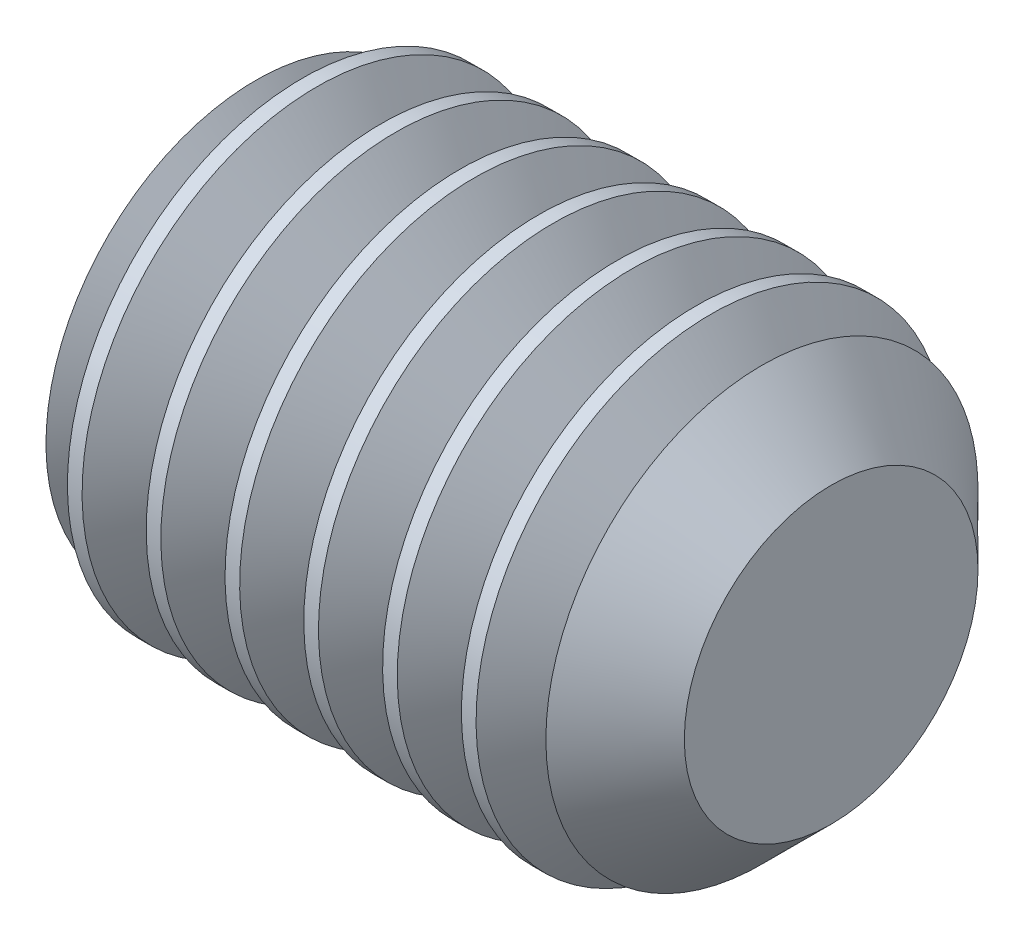
ISO-10303-21;
HEADER;
FILE_DESCRIPTION(('STEP AP214'),'2;1');
FILE_NAME('part.step','',(''),(''),'','','');
FILE_SCHEMA(('AUTOMOTIVE_DESIGN { 1 0 10303 214 1 1 1 1 }'));
ENDSEC;
DATA;
#1=APPLICATION_CONTEXT('core data for automotive mechanical design processes');
#2=APPLICATION_PROTOCOL_DEFINITION('international standard','automotive_design',2000,#1);
#3=PRODUCT_CONTEXT('',#1,'mechanical');
#4=PRODUCT('Part','Part','',(#3));
#5=PRODUCT_RELATED_PRODUCT_CATEGORY('part','',(#4));
#6=PRODUCT_DEFINITION_FORMATION('','',#4);
#7=PRODUCT_DEFINITION_CONTEXT('part definition',#1,'design');
#8=PRODUCT_DEFINITION('design','',#6,#7);
#9=PRODUCT_DEFINITION_SHAPE('','',#8);
#10=(LENGTH_UNIT() NAMED_UNIT(*) SI_UNIT(.MILLI.,.METRE.));
#11=(NAMED_UNIT(*) PLANE_ANGLE_UNIT() SI_UNIT($,.RADIAN.));
#12=(NAMED_UNIT(*) SI_UNIT($,.STERADIAN.) SOLID_ANGLE_UNIT());
#13=UNCERTAINTY_MEASURE_WITH_UNIT(LENGTH_MEASURE(1.E-05),#10,'distance_accuracy_value','');
#14=(GEOMETRIC_REPRESENTATION_CONTEXT(3) GLOBAL_UNCERTAINTY_ASSIGNED_CONTEXT((#13)) GLOBAL_UNIT_ASSIGNED_CONTEXT((#10,
#11,#12)) REPRESENTATION_CONTEXT('',''));
#15=CARTESIAN_POINT('',(0.,0.,0.));
#16=DIRECTION('',(0.,0.,1.));
#17=DIRECTION('',(1.,0.,0.));
#18=AXIS2_PLACEMENT_3D('',#15,#16,#17);
#19=CARTESIAN_POINT('',(0.,0.,0.));
#20=DIRECTION('',(-1.,0.,0.));
#21=DIRECTION('',(0.,0.,1.));
#22=AXIS2_PLACEMENT_3D('',#19,#20,#21);
#23=PLANE('',#22);
#24=CARTESIAN_POINT('',(0.,0.,0.));
#25=DIRECTION('',(-1.,0.,0.));
#26=DIRECTION('',(0.,0.,1.));
#27=AXIS2_PLACEMENT_3D('',#24,#25,#26);
#28=CIRCLE('',#27,1.61);
#29=CARTESIAN_POINT('',(0.,0.,1.61));
#30=VERTEX_POINT('',#29);
#31=EDGE_CURVE('E26',#30,#30,#28,.T.);
#32=ORIENTED_EDGE('',*,*,#31,.T.);
#33=EDGE_LOOP('',(#32));
#34=FACE_BOUND('',#33,.T.);
#35=DIRECTION('',(0.,0.,-1.));
#36=VECTOR('',#35,1.);
#37=CARTESIAN_POINT('',(0.,1.,0.577350269189622));
#38=LINE('',#37,#36);
#39=CARTESIAN_POINT('',(0.,1.,0.577350269189622));
#40=VERTEX_POINT('',#39);
#41=CARTESIAN_POINT('',(0.,1.,-0.577350269189629));
#42=VERTEX_POINT('',#41);
#43=EDGE_CURVE('E113',#40,#42,#38,.T.);
#44=ORIENTED_EDGE('',*,*,#43,.F.);
#45=DIRECTION('',(0.,-0.866025403784438,0.5));
#46=VECTOR('',#45,1.);
#47=CARTESIAN_POINT('',(0.,1.,0.577350269189622));
#48=LINE('',#47,#46);
#49=CARTESIAN_POINT('',(0.,0.,1.15470053837925));
#50=VERTEX_POINT('',#49);
#51=EDGE_CURVE('E34',#40,#50,#48,.T.);
#52=ORIENTED_EDGE('',*,*,#51,.T.);
#53=DIRECTION('',(0.,0.866025403784439,0.5));
#54=VECTOR('',#53,1.);
#55=CARTESIAN_POINT('',(0.,-1.,0.577350269189623));
#56=LINE('',#55,#54);
#57=CARTESIAN_POINT('',(0.,-1.,0.577350269189623));
#58=VERTEX_POINT('',#57);
#59=EDGE_CURVE('E103',#58,#50,#56,.T.);
#60=ORIENTED_EDGE('',*,*,#59,.F.);
#61=DIRECTION('',(0.,0.,-1.));
#62=VECTOR('',#61,1.);
#63=CARTESIAN_POINT('',(0.,-1.,0.577350269189623));
#64=LINE('',#63,#62);
#65=CARTESIAN_POINT('',(0.,-1.,-0.577350269189628));
#66=VERTEX_POINT('',#65);
#67=EDGE_CURVE('E107',#58,#66,#64,.T.);
#68=ORIENTED_EDGE('',*,*,#67,.T.);
#69=DIRECTION('',(0.,0.866025403784438,-0.5));
#70=VECTOR('',#69,1.);
#71=CARTESIAN_POINT('',(0.,-1.,-0.577350269189628));
#72=LINE('',#71,#70);
#73=CARTESIAN_POINT('',(0.,0.,-1.15470053837925));
#74=VERTEX_POINT('',#73);
#75=EDGE_CURVE('E110',#66,#74,#72,.T.);
#76=ORIENTED_EDGE('',*,*,#75,.T.);
#77=DIRECTION('',(0.,-0.866025403784439,-0.5));
#78=VECTOR('',#77,1.);
#79=CARTESIAN_POINT('',(0.,1.,-0.577350269189629));
#80=LINE('',#79,#78);
#81=EDGE_CURVE('E92',#42,#74,#80,.T.);
#82=ORIENTED_EDGE('',*,*,#81,.F.);
#83=EDGE_LOOP('',(#44,#52,#60,#68,#76,#82));
#84=FACE_BOUND('',#83,.T.);
#85=ADVANCED_FACE('F17',(#34,#84),#23,.T.);
#86=CARTESIAN_POINT('',(0.,0.,0.));
#87=DIRECTION('',(1.,0.,0.));
#88=DIRECTION('',(0.,0.,-1.));
#89=AXIS2_PLACEMENT_3D('',#86,#87,#88);
#90=CONICAL_SURFACE('',#89,1.61,1.0471975511966);
#91=CARTESIAN_POINT('',(0.101756647916099,0.,0.));
#92=DIRECTION('',(-1.,0.,0.));
#93=DIRECTION('',(0.,-1.,0.));
#94=AXIS2_PLACEMENT_3D('',#91,#92,#93);
#95=CIRCLE('',#94,1.78624768419859);
#96=CARTESIAN_POINT('',(0.1017566479161,-1.78624768419859,0.));
#97=VERTEX_POINT('',#96);
#98=EDGE_CURVE('E104',#97,#97,#95,.F.);
#99=ORIENTED_EDGE('',*,*,#98,.F.);
#100=EDGE_LOOP('',(#99));
#101=FACE_BOUND('',#100,.T.);
#102=ORIENTED_EDGE('',*,*,#31,.F.);
#103=EDGE_LOOP('',(#102));
#104=FACE_BOUND('',#103,.T.);
#105=ADVANCED_FACE('F149',(#101,#104),#90,.T.);
#106=CARTESIAN_POINT('',(2.3,1.,0.577350269189622));
#107=DIRECTION('',(0.,-0.5,-0.866025403784438));
#108=DIRECTION('',(0.,0.866025403784438,-0.5));
#109=AXIS2_PLACEMENT_3D('',#106,#107,#108);
#110=PLANE('',#109);
#111=ORIENTED_EDGE('',*,*,#51,.F.);
#112=DIRECTION('',(-1.,0.,0.));
#113=VECTOR('',#112,1.);
#114=CARTESIAN_POINT('',(2.3,1.,0.577350269189622));
#115=LINE('',#114,#113);
#116=CARTESIAN_POINT('',(2.3,1.,0.577350269189622));
#117=VERTEX_POINT('',#116);
#118=EDGE_CURVE('E39',#117,#40,#115,.T.);
#119=ORIENTED_EDGE('',*,*,#118,.F.);
#120=DIRECTION('',(0.,-0.866025403784438,0.5));
#121=VECTOR('',#120,1.);
#122=CARTESIAN_POINT('',(2.3,1.,0.577350269189622));
#123=LINE('',#122,#121);
#124=CARTESIAN_POINT('',(2.3,0.,1.15470053837925));
#125=VERTEX_POINT('',#124);
#126=EDGE_CURVE('E66',#117,#125,#123,.T.);
#127=ORIENTED_EDGE('',*,*,#126,.T.);
#128=DIRECTION('',(-1.,0.,0.));
#129=VECTOR('',#128,1.);
#130=CARTESIAN_POINT('',(2.3,0.,1.15470053837925));
#131=LINE('',#130,#129);
#132=EDGE_CURVE('E120',#125,#50,#131,.T.);
#133=ORIENTED_EDGE('',*,*,#132,.T.);
#134=EDGE_LOOP('',(#111,#119,#127,#133));
#135=FACE_BOUND('',#134,.T.);
#136=ADVANCED_FACE('F147',(#135),#110,.T.);
#137=CARTESIAN_POINT('',(2.3,-1.,0.577350269189623));
#138=DIRECTION('',(0.,-0.5,0.866025403784439));
#139=DIRECTION('',(0.,-0.866025403784439,-0.5));
#140=AXIS2_PLACEMENT_3D('',#137,#138,#139);
#141=PLANE('',#140);
#142=ORIENTED_EDGE('',*,*,#59,.T.);
#143=ORIENTED_EDGE('',*,*,#132,.F.);
#144=DIRECTION('',(0.,0.866025403784439,0.5));
#145=VECTOR('',#144,1.);
#146=CARTESIAN_POINT('',(2.3,-1.,0.577350269189623));
#147=LINE('',#146,#145);
#148=CARTESIAN_POINT('',(2.3,-1.,0.577350269189623));
#149=VERTEX_POINT('',#148);
#150=EDGE_CURVE('E138',#149,#125,#147,.T.);
#151=ORIENTED_EDGE('',*,*,#150,.F.);
#152=DIRECTION('',(-1.,0.,0.));
#153=VECTOR('',#152,1.);
#154=CARTESIAN_POINT('',(2.3,-1.,0.577350269189623));
#155=LINE('',#154,#153);
#156=EDGE_CURVE('E118',#149,#58,#155,.T.);
#157=ORIENTED_EDGE('',*,*,#156,.T.);
#158=EDGE_LOOP('',(#142,#143,#151,#157));
#159=FACE_BOUND('',#158,.T.);
#160=ADVANCED_FACE('F145',(#159),#141,.F.);
#161=CARTESIAN_POINT('',(2.3,-1.,0.577350269189623));
#162=DIRECTION('',(0.,1.,0.));
#163=DIRECTION('',(0.,0.,1.));
#164=AXIS2_PLACEMENT_3D('',#161,#162,#163);
#165=PLANE('',#164);
#166=ORIENTED_EDGE('',*,*,#67,.F.);
#167=ORIENTED_EDGE('',*,*,#156,.F.);
#168=DIRECTION('',(0.,0.,-1.));
#169=VECTOR('',#168,1.);
#170=CARTESIAN_POINT('',(2.3,-1.,0.577350269189623));
#171=LINE('',#170,#169);
#172=CARTESIAN_POINT('',(2.3,-1.,-0.577350269189628));
#173=VERTEX_POINT('',#172);
#174=EDGE_CURVE('E87',#149,#173,#171,.T.);
#175=ORIENTED_EDGE('',*,*,#174,.T.);
#176=DIRECTION('',(-1.,0.,0.));
#177=VECTOR('',#176,1.);
#178=CARTESIAN_POINT('',(2.3,-1.,-0.577350269189628));
#179=LINE('',#178,#177);
#180=EDGE_CURVE('E82',#173,#66,#179,.T.);
#181=ORIENTED_EDGE('',*,*,#180,.T.);
#182=EDGE_LOOP('',(#166,#167,#175,#181));
#183=FACE_BOUND('',#182,.T.);
#184=ADVANCED_FACE('F142',(#183),#165,.T.);
#185=CARTESIAN_POINT('',(2.3,-1.,-0.577350269189628));
#186=DIRECTION('',(0.,0.5,0.866025403784438));
#187=DIRECTION('',(0.,-0.866025403784439,0.5));
#188=AXIS2_PLACEMENT_3D('',#185,#186,#187);
#189=PLANE('',#188);
#190=ORIENTED_EDGE('',*,*,#75,.F.);
#191=ORIENTED_EDGE('',*,*,#180,.F.);
#192=DIRECTION('',(0.,0.866025403784438,-0.5));
#193=VECTOR('',#192,1.);
#194=CARTESIAN_POINT('',(2.3,-1.,-0.577350269189628));
#195=LINE('',#194,#193);
#196=CARTESIAN_POINT('',(2.3,0.,-1.15470053837925));
#197=VERTEX_POINT('',#196);
#198=EDGE_CURVE('E77',#173,#197,#195,.T.);
#199=ORIENTED_EDGE('',*,*,#198,.T.);
#200=DIRECTION('',(-1.,0.,0.));
#201=VECTOR('',#200,1.);
#202=CARTESIAN_POINT('',(2.3,0.,-1.15470053837925));
#203=LINE('',#202,#201);
#204=EDGE_CURVE('E81',#197,#74,#203,.T.);
#205=ORIENTED_EDGE('',*,*,#204,.T.);
#206=EDGE_LOOP('',(#190,#191,#199,#205));
#207=FACE_BOUND('',#206,.T.);
#208=ADVANCED_FACE('F80',(#207),#189,.T.);
#209=CARTESIAN_POINT('',(2.3,1.,-0.577350269189629));
#210=DIRECTION('',(0.,0.5,-0.866025403784439));
#211=DIRECTION('',(0.,0.866025403784439,0.5));
#212=AXIS2_PLACEMENT_3D('',#209,#210,#211);
#213=PLANE('',#212);
#214=ORIENTED_EDGE('',*,*,#81,.T.);
#215=ORIENTED_EDGE('',*,*,#204,.F.);
#216=DIRECTION('',(0.,-0.866025403784439,-0.5));
#217=VECTOR('',#216,1.);
#218=CARTESIAN_POINT('',(2.3,1.,-0.577350269189629));
#219=LINE('',#218,#217);
#220=CARTESIAN_POINT('',(2.3,1.,-0.577350269189629));
#221=VERTEX_POINT('',#220);
#222=EDGE_CURVE('E86',#221,#197,#219,.T.);
#223=ORIENTED_EDGE('',*,*,#222,.F.);
#224=DIRECTION('',(-1.,0.,0.));
#225=VECTOR('',#224,1.);
#226=CARTESIAN_POINT('',(2.3,1.,-0.577350269189629));
#227=LINE('',#226,#225);
#228=EDGE_CURVE('E62',#221,#42,#227,.T.);
#229=ORIENTED_EDGE('',*,*,#228,.T.);
#230=EDGE_LOOP('',(#214,#215,#223,#229));
#231=FACE_BOUND('',#230,.T.);
#232=ADVANCED_FACE('F89',(#231),#213,.F.);
#233=CARTESIAN_POINT('',(2.3,1.,0.577350269189622));
#234=DIRECTION('',(0.,1.,0.));
#235=DIRECTION('',(0.,0.,1.));
#236=AXIS2_PLACEMENT_3D('',#233,#234,#235);
#237=PLANE('',#236);
#238=ORIENTED_EDGE('',*,*,#43,.T.);
#239=ORIENTED_EDGE('',*,*,#228,.F.);
#240=DIRECTION('',(0.,0.,-1.));
#241=VECTOR('',#240,1.);
#242=CARTESIAN_POINT('',(2.3,1.,0.577350269189622));
#243=LINE('',#242,#241);
#244=EDGE_CURVE('E97',#117,#221,#243,.T.);
#245=ORIENTED_EDGE('',*,*,#244,.F.);
#246=ORIENTED_EDGE('',*,*,#118,.T.);
#247=EDGE_LOOP('',(#238,#239,#245,#246));
#248=FACE_BOUND('',#247,.T.);
#249=ADVANCED_FACE('F333',(#248),#237,.F.);
#250=CARTESIAN_POINT('',(2.3,2.,0.));
#251=DIRECTION('',(1.,0.,0.));
#252=DIRECTION('',(0.,0.,-1.));
#253=AXIS2_PLACEMENT_3D('',#250,#251,#252);
#254=PLANE('',#253);
#255=ORIENTED_EDGE('',*,*,#126,.F.);
#256=ORIENTED_EDGE('',*,*,#244,.T.);
#257=ORIENTED_EDGE('',*,*,#222,.T.);
#258=ORIENTED_EDGE('',*,*,#198,.F.);
#259=ORIENTED_EDGE('',*,*,#174,.F.);
#260=ORIENTED_EDGE('',*,*,#150,.T.);
#261=EDGE_LOOP('',(#255,#256,#257,#258,#259,#260));
#262=FACE_BOUND('',#261,.T.);
#263=ADVANCED_FACE('F95',(#262),#254,.F.);
#264=CARTESIAN_POINT('',(0.498247544885738,0.,0.));
#265=DIRECTION('',(1.,0.,0.));
#266=DIRECTION('',(0.,1.,0.));
#267=AXIS2_PLACEMENT_3D('',#264,#265,#266);
#268=CONICAL_SURFACE('',#267,2.,0.959931088596884);
#269=CARTESIAN_POINT('',(0.225166604983952,0.,0.));
#270=DIRECTION('',(-1.,0.,0.));
#271=DIRECTION('',(0.,-1.,0.));
#272=AXIS2_PLACEMENT_3D('',#269,#270,#271);
#273=CIRCLE('',#272,1.61);
#274=CARTESIAN_POINT('',(0.225166604983953,-1.61,0.));
#275=VERTEX_POINT('',#274);
#276=EDGE_CURVE('E128',#275,#275,#273,.T.);
#277=ORIENTED_EDGE('',*,*,#276,.F.);
#278=EDGE_LOOP('',(#277));
#279=FACE_BOUND('',#278,.T.);
#280=CARTESIAN_POINT('',(0.498247544885738,0.,0.));
#281=DIRECTION('',(-1.,0.,0.));
#282=DIRECTION('',(0.,-1.,0.));
#283=AXIS2_PLACEMENT_3D('',#280,#281,#282);
#284=CIRCLE('',#283,2.);
#285=CARTESIAN_POINT('',(0.498247544885738,-2.,0.));
#286=VERTEX_POINT('',#285);
#287=EDGE_CURVE('E124',#286,#286,#284,.T.);
#288=ORIENTED_EDGE('',*,*,#287,.T.);
#289=EDGE_LOOP('',(#288));
#290=FACE_BOUND('',#289,.T.);
#291=ADVANCED_FACE('F327',(#279,#290),#268,.T.);
#292=CARTESIAN_POINT('',(0.225166604983952,0.,0.));
#293=DIRECTION('',(-1.,0.,0.));
#294=DIRECTION('',(0.,-1.,0.));
#295=AXIS2_PLACEMENT_3D('',#292,#293,#294);
#296=CONICAL_SURFACE('',#295,1.61,0.959931088596876);
#297=ORIENTED_EDGE('',*,*,#98,.T.);
#298=EDGE_LOOP('',(#297));
#299=FACE_BOUND('',#298,.T.);
#300=ORIENTED_EDGE('',*,*,#276,.T.);
#301=EDGE_LOOP('',(#300));
#302=FACE_BOUND('',#301,.T.);
#303=ADVANCED_FACE('F171',(#299,#302),#296,.T.);
#304=CARTESIAN_POINT('',(-12.7,0.,0.));
#305=DIRECTION('',(-1.,0.,0.));
#306=DIRECTION('',(0.,0.,1.));
#307=AXIS2_PLACEMENT_3D('',#304,#305,#306);
#308=CYLINDRICAL_SURFACE('',#307,2.);
#309=CARTESIAN_POINT('',(0.622891234063827,0.,0.));
#310=DIRECTION('',(-1.,0.,0.));
#311=DIRECTION('',(0.,-1.,0.));
#312=AXIS2_PLACEMENT_3D('',#309,#310,#311);
#313=CIRCLE('',#312,2.);
#314=CARTESIAN_POINT('',(0.622891234063827,-2.,0.));
#315=VERTEX_POINT('',#314);
#316=EDGE_CURVE('E237',#315,#315,#313,.T.);
#317=ORIENTED_EDGE('',*,*,#316,.T.);
#318=EDGE_LOOP('',(#317));
#319=FACE_BOUND('',#318,.T.);
#320=ORIENTED_EDGE('',*,*,#287,.F.);
#321=EDGE_LOOP('',(#320));
#322=FACE_BOUND('',#321,.T.);
#323=ADVANCED_FACE('F168',(#319,#322),#308,.T.);
#324=CARTESIAN_POINT('',(1.1690531138674,0.,0.));
#325=DIRECTION('',(1.,0.,0.));
#326=DIRECTION('',(0.,1.,0.));
#327=AXIS2_PLACEMENT_3D('',#324,#325,#326);
#328=CONICAL_SURFACE('',#327,2.,0.959931088596884);
#329=CARTESIAN_POINT('',(0.895972173965617,0.,0.));
#330=DIRECTION('',(-1.,0.,0.));
#331=DIRECTION('',(0.,-1.,0.));
#332=AXIS2_PLACEMENT_3D('',#329,#330,#331);
#333=CIRCLE('',#332,1.61);
#334=CARTESIAN_POINT('',(0.895972173965617,-1.61,0.));
#335=VERTEX_POINT('',#334);
#336=EDGE_CURVE('E234',#335,#335,#333,.T.);
#337=ORIENTED_EDGE('',*,*,#336,.F.);
#338=EDGE_LOOP('',(#337));
#339=FACE_BOUND('',#338,.T.);
#340=CARTESIAN_POINT('',(1.1690531138674,0.,0.));
#341=DIRECTION('',(-1.,0.,0.));
#342=DIRECTION('',(0.,-1.,0.));
#343=AXIS2_PLACEMENT_3D('',#340,#341,#342);
#344=CIRCLE('',#343,2.);
#345=CARTESIAN_POINT('',(1.1690531138674,-2.,0.));
#346=VERTEX_POINT('',#345);
#347=EDGE_CURVE('E133',#346,#346,#344,.T.);
#348=ORIENTED_EDGE('',*,*,#347,.T.);
#349=EDGE_LOOP('',(#348));
#350=FACE_BOUND('',#349,.T.);
#351=ADVANCED_FACE('F170',(#339,#350),#328,.T.);
#352=CARTESIAN_POINT('',(0.895972173965617,0.,0.));
#353=DIRECTION('',(-1.,0.,0.));
#354=DIRECTION('',(0.,-1.,0.));
#355=AXIS2_PLACEMENT_3D('',#352,#353,#354);
#356=CONICAL_SURFACE('',#355,1.61,0.959931088596876);
#357=ORIENTED_EDGE('',*,*,#316,.F.);
#358=EDGE_LOOP('',(#357));
#359=FACE_BOUND('',#358,.T.);
#360=ORIENTED_EDGE('',*,*,#336,.T.);
#361=EDGE_LOOP('',(#360));
#362=FACE_BOUND('',#361,.T.);
#363=ADVANCED_FACE('F245',(#359,#362),#356,.T.);
#364=CARTESIAN_POINT('',(1.29369680304549,0.,0.));
#365=DIRECTION('',(-1.,0.,0.));
#366=DIRECTION('',(0.,-1.,0.));
#367=AXIS2_PLACEMENT_3D('',#364,#365,#366);
#368=CIRCLE('',#367,2.);
#369=CARTESIAN_POINT('',(1.29369680304549,-2.,0.));
#370=VERTEX_POINT('',#369);
#371=EDGE_CURVE('E228',#370,#370,#368,.T.);
#372=ORIENTED_EDGE('',*,*,#371,.T.);
#373=EDGE_LOOP('',(#372));
#374=FACE_BOUND('',#373,.T.);
#375=ORIENTED_EDGE('',*,*,#347,.F.);
#376=EDGE_LOOP('',(#375));
#377=FACE_BOUND('',#376,.T.);
#378=ADVANCED_FACE('F174',(#374,#377),#308,.T.);
#379=CARTESIAN_POINT('',(1.83985868284907,0.,0.));
#380=DIRECTION('',(1.,0.,0.));
#381=DIRECTION('',(0.,1.,0.));
#382=AXIS2_PLACEMENT_3D('',#379,#380,#381);
#383=CONICAL_SURFACE('',#382,2.,0.959931088596884);
#384=CARTESIAN_POINT('',(1.56677774294728,0.,0.));
#385=DIRECTION('',(-1.,0.,0.));
#386=DIRECTION('',(0.,-1.,0.));
#387=AXIS2_PLACEMENT_3D('',#384,#385,#386);
#388=CIRCLE('',#387,1.61);
#389=CARTESIAN_POINT('',(1.56677774294728,-1.61,0.));
#390=VERTEX_POINT('',#389);
#391=EDGE_CURVE('E225',#390,#390,#388,.T.);
#392=ORIENTED_EDGE('',*,*,#391,.F.);
#393=EDGE_LOOP('',(#392));
#394=FACE_BOUND('',#393,.T.);
#395=CARTESIAN_POINT('',(1.83985868284907,0.,0.));
#396=DIRECTION('',(-1.,0.,0.));
#397=DIRECTION('',(0.,-1.,0.));
#398=AXIS2_PLACEMENT_3D('',#395,#396,#397);
#399=CIRCLE('',#398,2.);
#400=CARTESIAN_POINT('',(1.83985868284907,-2.,0.));
#401=VERTEX_POINT('',#400);
#402=EDGE_CURVE('E231',#401,#401,#399,.T.);
#403=ORIENTED_EDGE('',*,*,#402,.T.);
#404=EDGE_LOOP('',(#403));
#405=FACE_BOUND('',#404,.T.);
#406=ADVANCED_FACE('F244',(#394,#405),#383,.T.);
#407=CARTESIAN_POINT('',(1.56677774294728,0.,0.));
#408=DIRECTION('',(-1.,0.,0.));
#409=DIRECTION('',(0.,-1.,0.));
#410=AXIS2_PLACEMENT_3D('',#407,#408,#409);
#411=CONICAL_SURFACE('',#410,1.61,0.959931088596876);
#412=ORIENTED_EDGE('',*,*,#371,.F.);
#413=EDGE_LOOP('',(#412));
#414=FACE_BOUND('',#413,.T.);
#415=ORIENTED_EDGE('',*,*,#391,.T.);
#416=EDGE_LOOP('',(#415));
#417=FACE_BOUND('',#416,.T.);
#418=ADVANCED_FACE('F253',(#414,#417),#411,.T.);
#419=CARTESIAN_POINT('',(1.96450237202716,0.,0.));
#420=DIRECTION('',(-1.,0.,0.));
#421=DIRECTION('',(0.,-1.,0.));
#422=AXIS2_PLACEMENT_3D('',#419,#420,#421);
#423=CIRCLE('',#422,2.);
#424=CARTESIAN_POINT('',(1.96450237202716,-2.,0.));
#425=VERTEX_POINT('',#424);
#426=EDGE_CURVE('E219',#425,#425,#423,.T.);
#427=ORIENTED_EDGE('',*,*,#426,.T.);
#428=EDGE_LOOP('',(#427));
#429=FACE_BOUND('',#428,.T.);
#430=ORIENTED_EDGE('',*,*,#402,.F.);
#431=EDGE_LOOP('',(#430));
#432=FACE_BOUND('',#431,.T.);
#433=ADVANCED_FACE('F247',(#429,#432),#308,.T.);
#434=CARTESIAN_POINT('',(2.51066425183073,0.,0.));
#435=DIRECTION('',(1.,0.,0.));
#436=DIRECTION('',(0.,1.,0.));
#437=AXIS2_PLACEMENT_3D('',#434,#435,#436);
#438=CONICAL_SURFACE('',#437,2.,0.959931088596884);
#439=CARTESIAN_POINT('',(2.23758331192894,0.,0.));
#440=DIRECTION('',(-1.,0.,0.));
#441=DIRECTION('',(0.,-1.,0.));
#442=AXIS2_PLACEMENT_3D('',#439,#440,#441);
#443=CIRCLE('',#442,1.61);
#444=CARTESIAN_POINT('',(2.23758331192894,-1.61,0.));
#445=VERTEX_POINT('',#444);
#446=EDGE_CURVE('E216',#445,#445,#443,.T.);
#447=ORIENTED_EDGE('',*,*,#446,.F.);
#448=EDGE_LOOP('',(#447));
#449=FACE_BOUND('',#448,.T.);
#450=CARTESIAN_POINT('',(2.51066425183073,0.,0.));
#451=DIRECTION('',(-1.,0.,0.));
#452=DIRECTION('',(0.,-1.,0.));
#453=AXIS2_PLACEMENT_3D('',#450,#451,#452);
#454=CIRCLE('',#453,2.);
#455=CARTESIAN_POINT('',(2.51066425183073,-2.,0.));
#456=VERTEX_POINT('',#455);
#457=EDGE_CURVE('E222',#456,#456,#454,.T.);
#458=ORIENTED_EDGE('',*,*,#457,.T.);
#459=EDGE_LOOP('',(#458));
#460=FACE_BOUND('',#459,.T.);
#461=ADVANCED_FACE('F259',(#449,#460),#438,.T.);
#462=CARTESIAN_POINT('',(2.23758331192894,0.,0.));
#463=DIRECTION('',(-1.,0.,0.));
#464=DIRECTION('',(0.,-1.,0.));
#465=AXIS2_PLACEMENT_3D('',#462,#463,#464);
#466=CONICAL_SURFACE('',#465,1.61,0.959931088596876);
#467=ORIENTED_EDGE('',*,*,#426,.F.);
#468=EDGE_LOOP('',(#467));
#469=FACE_BOUND('',#468,.T.);
#470=ORIENTED_EDGE('',*,*,#446,.T.);
#471=EDGE_LOOP('',(#470));
#472=FACE_BOUND('',#471,.T.);
#473=ADVANCED_FACE('F267',(#469,#472),#466,.T.);
#474=CARTESIAN_POINT('',(2.63530794100882,0.,0.));
#475=DIRECTION('',(-1.,0.,0.));
#476=DIRECTION('',(0.,-1.,0.));
#477=AXIS2_PLACEMENT_3D('',#474,#475,#476);
#478=CIRCLE('',#477,2.);
#479=CARTESIAN_POINT('',(2.63530794100882,-2.,0.));
#480=VERTEX_POINT('',#479);
#481=EDGE_CURVE('E210',#480,#480,#478,.T.);
#482=ORIENTED_EDGE('',*,*,#481,.T.);
#483=EDGE_LOOP('',(#482));
#484=FACE_BOUND('',#483,.T.);
#485=ORIENTED_EDGE('',*,*,#457,.F.);
#486=EDGE_LOOP('',(#485));
#487=FACE_BOUND('',#486,.T.);
#488=ADVANCED_FACE('F261',(#484,#487),#308,.T.);
#489=CARTESIAN_POINT('',(3.18146982081239,0.,0.));
#490=DIRECTION('',(1.,0.,0.));
#491=DIRECTION('',(0.,1.,0.));
#492=AXIS2_PLACEMENT_3D('',#489,#490,#491);
#493=CONICAL_SURFACE('',#492,2.,0.959931088596884);
#494=CARTESIAN_POINT('',(2.90838888091061,0.,0.));
#495=DIRECTION('',(-1.,0.,0.));
#496=DIRECTION('',(0.,-1.,0.));
#497=AXIS2_PLACEMENT_3D('',#494,#495,#496);
#498=CIRCLE('',#497,1.61);
#499=CARTESIAN_POINT('',(2.90838888091061,-1.61,0.));
#500=VERTEX_POINT('',#499);
#501=EDGE_CURVE('E207',#500,#500,#498,.T.);
#502=ORIENTED_EDGE('',*,*,#501,.F.);
#503=EDGE_LOOP('',(#502));
#504=FACE_BOUND('',#503,.T.);
#505=CARTESIAN_POINT('',(3.18146982081239,0.,0.));
#506=DIRECTION('',(-1.,0.,0.));
#507=DIRECTION('',(0.,-1.,0.));
#508=AXIS2_PLACEMENT_3D('',#505,#506,#507);
#509=CIRCLE('',#508,2.);
#510=CARTESIAN_POINT('',(3.1814698208124,-2.,0.));
#511=VERTEX_POINT('',#510);
#512=EDGE_CURVE('E213',#511,#511,#509,.T.);
#513=ORIENTED_EDGE('',*,*,#512,.T.);
#514=EDGE_LOOP('',(#513));
#515=FACE_BOUND('',#514,.T.);
#516=ADVANCED_FACE('F274',(#504,#515),#493,.T.);
#517=CARTESIAN_POINT('',(2.90838888091061,0.,0.));
#518=DIRECTION('',(-1.,0.,0.));
#519=DIRECTION('',(0.,-1.,0.));
#520=AXIS2_PLACEMENT_3D('',#517,#518,#519);
#521=CONICAL_SURFACE('',#520,1.61,0.959931088596876);
#522=ORIENTED_EDGE('',*,*,#481,.F.);
#523=EDGE_LOOP('',(#522));
#524=FACE_BOUND('',#523,.T.);
#525=ORIENTED_EDGE('',*,*,#501,.T.);
#526=EDGE_LOOP('',(#525));
#527=FACE_BOUND('',#526,.T.);
#528=ADVANCED_FACE('F282',(#524,#527),#521,.T.);
#529=CARTESIAN_POINT('',(3.30611350999048,0.,0.));
#530=DIRECTION('',(-1.,0.,0.));
#531=DIRECTION('',(0.,-1.,0.));
#532=AXIS2_PLACEMENT_3D('',#529,#530,#531);
#533=CIRCLE('',#532,2.);
#534=CARTESIAN_POINT('',(3.30611350999049,-2.,0.));
#535=VERTEX_POINT('',#534);
#536=EDGE_CURVE('E192',#535,#535,#533,.T.);
#537=ORIENTED_EDGE('',*,*,#536,.T.);
#538=EDGE_LOOP('',(#537));
#539=FACE_BOUND('',#538,.T.);
#540=ORIENTED_EDGE('',*,*,#512,.F.);
#541=EDGE_LOOP('',(#540));
#542=FACE_BOUND('',#541,.T.);
#543=ADVANCED_FACE('F276',(#539,#542),#308,.T.);
#544=CARTESIAN_POINT('',(3.85227538979406,0.,0.));
#545=DIRECTION('',(1.,0.,0.));
#546=DIRECTION('',(0.,1.,0.));
#547=AXIS2_PLACEMENT_3D('',#544,#545,#546);
#548=CONICAL_SURFACE('',#547,2.,0.959931088596884);
#549=CARTESIAN_POINT('',(3.57919444989227,0.,0.));
#550=DIRECTION('',(-1.,0.,0.));
#551=DIRECTION('',(0.,-1.,0.));
#552=AXIS2_PLACEMENT_3D('',#549,#550,#551);
#553=CIRCLE('',#552,1.61);
#554=CARTESIAN_POINT('',(3.57919444989227,-1.61,0.));
#555=VERTEX_POINT('',#554);
#556=EDGE_CURVE('E189',#555,#555,#553,.T.);
#557=ORIENTED_EDGE('',*,*,#556,.F.);
#558=EDGE_LOOP('',(#557));
#559=FACE_BOUND('',#558,.T.);
#560=CARTESIAN_POINT('',(3.85227538979406,0.,0.));
#561=DIRECTION('',(-1.,0.,0.));
#562=DIRECTION('',(0.,-1.,0.));
#563=AXIS2_PLACEMENT_3D('',#560,#561,#562);
#564=CIRCLE('',#563,2.);
#565=CARTESIAN_POINT('',(3.85227538979406,-2.,0.));
#566=VERTEX_POINT('',#565);
#567=EDGE_CURVE('E204',#566,#566,#564,.T.);
#568=ORIENTED_EDGE('',*,*,#567,.T.);
#569=EDGE_LOOP('',(#568));
#570=FACE_BOUND('',#569,.T.);
#571=ADVANCED_FACE('F289',(#559,#570),#548,.T.);
#572=CARTESIAN_POINT('',(3.57919444989227,0.,0.));
#573=DIRECTION('',(-1.,0.,0.));
#574=DIRECTION('',(0.,-1.,0.));
#575=AXIS2_PLACEMENT_3D('',#572,#573,#574);
#576=CONICAL_SURFACE('',#575,1.61,0.959931088596876);
#577=ORIENTED_EDGE('',*,*,#536,.F.);
#578=EDGE_LOOP('',(#577));
#579=FACE_BOUND('',#578,.T.);
#580=ORIENTED_EDGE('',*,*,#556,.T.);
#581=EDGE_LOOP('',(#580));
#582=FACE_BOUND('',#581,.T.);
#583=ADVANCED_FACE('F296',(#579,#582),#576,.T.);
#584=CARTESIAN_POINT('',(3.97691907897215,0.,0.));
#585=DIRECTION('',(-1.,0.,0.));
#586=DIRECTION('',(0.,-1.,0.));
#587=AXIS2_PLACEMENT_3D('',#584,#585,#586);
#588=CIRCLE('',#587,2.);
#589=CARTESIAN_POINT('',(3.97691907897215,-2.,0.));
#590=VERTEX_POINT('',#589);
#591=EDGE_CURVE('E190',#590,#590,#588,.T.);
#592=ORIENTED_EDGE('',*,*,#591,.T.);
#593=EDGE_LOOP('',(#592));
#594=FACE_BOUND('',#593,.T.);
#595=ORIENTED_EDGE('',*,*,#567,.F.);
#596=EDGE_LOOP('',(#595));
#597=FACE_BOUND('',#596,.T.);
#598=ADVANCED_FACE('F173',(#594,#597),#308,.T.);
#599=CARTESIAN_POINT('',(4.52308095877572,0.,0.));
#600=DIRECTION('',(1.,0.,0.));
#601=DIRECTION('',(0.,1.,0.));
#602=AXIS2_PLACEMENT_3D('',#599,#600,#601);
#603=CONICAL_SURFACE('',#602,2.,0.959931088596884);
#604=CARTESIAN_POINT('',(4.41061624986281,0.,0.));
#605=DIRECTION('',(1.,0.,0.));
#606=DIRECTION('',(0.,1.,0.));
#607=AXIS2_PLACEMENT_3D('',#604,#605,#606);
#608=CIRCLE('',#607,1.8393837501372);
#609=CARTESIAN_POINT('',(4.41061624986281,1.8393837501372,0.));
#610=VERTEX_POINT('',#609);
#611=EDGE_CURVE('E21',#610,#610,#608,.F.);
#612=ORIENTED_EDGE('',*,*,#611,.T.);
#613=EDGE_LOOP('',(#612));
#614=FACE_BOUND('',#613,.T.);
#615=CARTESIAN_POINT('',(4.25000001887394,0.,0.));
#616=DIRECTION('',(-1.,0.,0.));
#617=DIRECTION('',(0.,-1.,0.));
#618=AXIS2_PLACEMENT_3D('',#615,#616,#617);
#619=CIRCLE('',#618,1.61);
#620=CARTESIAN_POINT('',(4.25000001887394,-1.61,0.));
#621=VERTEX_POINT('',#620);
#622=EDGE_CURVE('E195',#621,#621,#619,.T.);
#623=ORIENTED_EDGE('',*,*,#622,.F.);
#624=EDGE_LOOP('',(#623));
#625=FACE_BOUND('',#624,.T.);
#626=ADVANCED_FACE('F303',(#614,#625),#603,.T.);
#627=CARTESIAN_POINT('',(4.25000001887394,0.,0.));
#628=DIRECTION('',(-1.,0.,0.));
#629=DIRECTION('',(0.,-1.,0.));
#630=AXIS2_PLACEMENT_3D('',#627,#628,#629);
#631=CONICAL_SURFACE('',#630,1.61,0.959931088596876);
#632=ORIENTED_EDGE('',*,*,#591,.F.);
#633=EDGE_LOOP('',(#632));
#634=FACE_BOUND('',#633,.T.);
#635=ORIENTED_EDGE('',*,*,#622,.T.);
#636=EDGE_LOOP('',(#635));
#637=FACE_BOUND('',#636,.T.);
#638=ADVANCED_FACE('F182',(#634,#637),#631,.T.);
#639=CARTESIAN_POINT('',(5.,1.25,0.));
#640=DIRECTION('',(1.,0.,0.));
#641=DIRECTION('',(0.,0.,-1.));
#642=AXIS2_PLACEMENT_3D('',#639,#640,#641);
#643=PLANE('',#642);
#644=CARTESIAN_POINT('',(5.,0.,0.));
#645=DIRECTION('',(-1.,0.,0.));
#646=DIRECTION('',(0.,0.,1.));
#647=AXIS2_PLACEMENT_3D('',#644,#645,#646);
#648=CIRCLE('',#647,1.25);
#649=CARTESIAN_POINT('',(5.,0.,1.25));
#650=VERTEX_POINT('',#649);
#651=EDGE_CURVE('E11',#650,#650,#648,.T.);
#652=ORIENTED_EDGE('',*,*,#651,.F.);
#653=EDGE_LOOP('',(#652));
#654=FACE_BOUND('',#653,.T.);
#655=ADVANCED_FACE('F19',(#654),#643,.T.);
#656=CARTESIAN_POINT('',(4.25,0.,0.));
#657=DIRECTION('',(-1.,0.,0.));
#658=DIRECTION('',(0.,0.,1.));
#659=AXIS2_PLACEMENT_3D('',#656,#657,#658);
#660=CONICAL_SURFACE('',#659,2.,0.785398163397455);
#661=ORIENTED_EDGE('',*,*,#611,.F.);
#662=EDGE_LOOP('',(#661));
#663=FACE_BOUND('',#662,.T.);
#664=ORIENTED_EDGE('',*,*,#651,.T.);
#665=EDGE_LOOP('',(#664));
#666=FACE_BOUND('',#665,.T.);
#667=ADVANCED_FACE('F175',(#663,#666),#660,.T.);
#668=CLOSED_SHELL('',(#85,#105,#136,#160,#184,#208,#232,#249,#263,#291,#303,#323,#351,#363,#378,
#406,#418,#433,#461,#473,#488,#516,#528,#543,#571,#583,#598,#626,#638,#655,#667));
#669=MANIFOLD_SOLID_BREP('B1',#668);
#670=ADVANCED_BREP_SHAPE_REPRESENTATION('',(#18,#669),#14);
#671=SHAPE_DEFINITION_REPRESENTATION(#9,#670);
ENDSEC;
END-ISO-10303-21;
